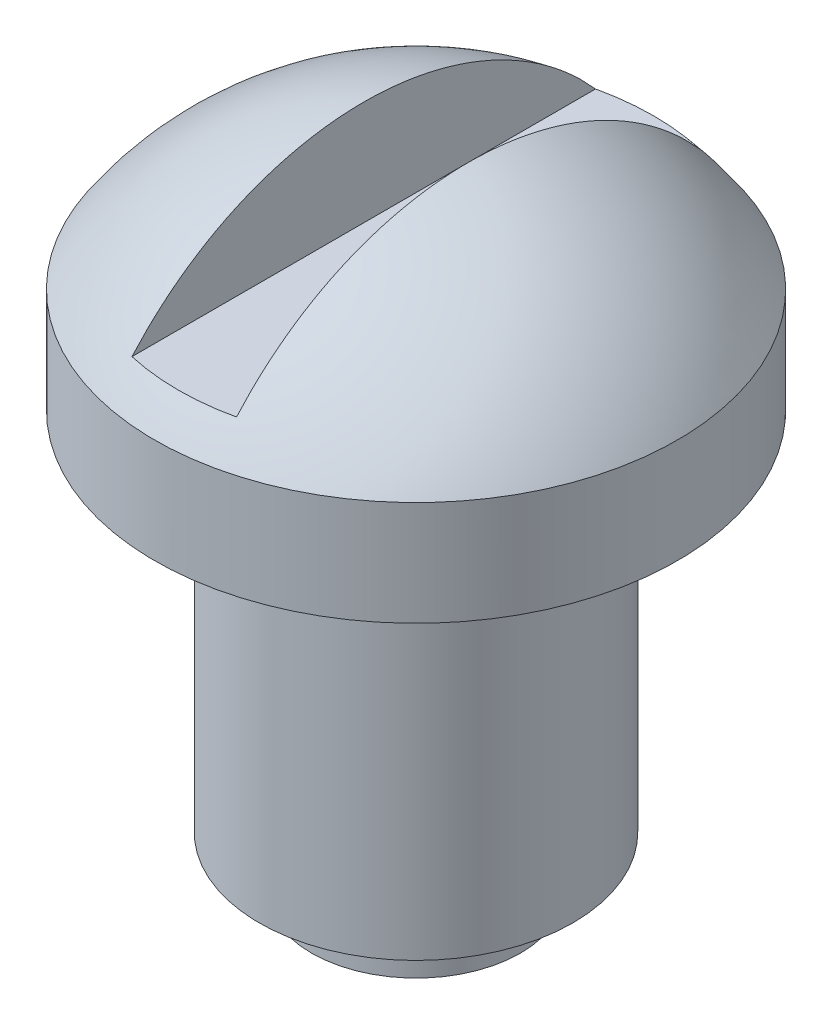
ISO-10303-21;
HEADER;
FILE_DESCRIPTION(('STEP AP214'),'2;1');
FILE_NAME('part.step','',(''),(''),'','','');
FILE_SCHEMA(('AUTOMOTIVE_DESIGN { 1 0 10303 214 1 1 1 1 }'));
ENDSEC;
DATA;
#1=APPLICATION_CONTEXT('core data for automotive mechanical design processes');
#2=APPLICATION_PROTOCOL_DEFINITION('international standard','automotive_design',2000,#1);
#3=PRODUCT_CONTEXT('',#1,'mechanical');
#4=PRODUCT('Part','Part','',(#3));
#5=PRODUCT_RELATED_PRODUCT_CATEGORY('part','',(#4));
#6=PRODUCT_DEFINITION_FORMATION('','',#4);
#7=PRODUCT_DEFINITION_CONTEXT('part definition',#1,'design');
#8=PRODUCT_DEFINITION('design','',#6,#7);
#9=PRODUCT_DEFINITION_SHAPE('','',#8);
#10=(LENGTH_UNIT() NAMED_UNIT(*) SI_UNIT(.MILLI.,.METRE.));
#11=(NAMED_UNIT(*) PLANE_ANGLE_UNIT() SI_UNIT($,.RADIAN.));
#12=(NAMED_UNIT(*) SI_UNIT($,.STERADIAN.) SOLID_ANGLE_UNIT());
#13=UNCERTAINTY_MEASURE_WITH_UNIT(LENGTH_MEASURE(1.E-05),#10,'distance_accuracy_value','');
#14=(GEOMETRIC_REPRESENTATION_CONTEXT(3) GLOBAL_UNCERTAINTY_ASSIGNED_CONTEXT((#13)) GLOBAL_UNIT_ASSIGNED_CONTEXT((#10,
#11,#12)) REPRESENTATION_CONTEXT('',''));
#15=CARTESIAN_POINT('',(0.,0.,0.));
#16=DIRECTION('',(0.,0.,1.));
#17=DIRECTION('',(1.,0.,0.));
#18=AXIS2_PLACEMENT_3D('',#15,#16,#17);
#19=CARTESIAN_POINT('',(0.,3.6833752096446,0.));
#20=DIRECTION('',(0.,1.,0.));
#21=DIRECTION('',(-1.,0.,0.));
#22=AXIS2_PLACEMENT_3D('',#19,#20,#21);
#23=CYLINDRICAL_SURFACE('',#22,5.);
#24=CARTESIAN_POINT('',(0.,1.,0.));
#25=DIRECTION('',(0.,1.,0.));
#26=DIRECTION('',(-1.,0.,0.));
#27=AXIS2_PLACEMENT_3D('',#24,#25,#26);
#28=CIRCLE('',#27,5.);
#29=CARTESIAN_POINT('',(-5.,1.,0.));
#30=VERTEX_POINT('',#29);
#31=EDGE_CURVE('E69',#30,#30,#28,.T.);
#32=ORIENTED_EDGE('',*,*,#31,.F.);
#33=EDGE_LOOP('',(#32));
#34=FACE_BOUND('',#33,.T.);
#35=CARTESIAN_POINT('',(0.,-1.,0.));
#36=DIRECTION('',(0.,1.,0.));
#37=DIRECTION('',(-1.,0.,0.));
#38=AXIS2_PLACEMENT_3D('',#35,#36,#37);
#39=CIRCLE('',#38,5.);
#40=CARTESIAN_POINT('',(-5.,-0.999999999999999,0.));
#41=VERTEX_POINT('',#40);
#42=EDGE_CURVE('E77',#41,#41,#39,.T.);
#43=ORIENTED_EDGE('',*,*,#42,.T.);
#44=EDGE_LOOP('',(#43));
#45=FACE_BOUND('',#44,.T.);
#46=ADVANCED_FACE('F33',(#34,#45),#23,.T.);
#47=CARTESIAN_POINT('',(0.,-2.3166247903554,0.));
#48=DIRECTION('',(0.,1.,0.));
#49=DIRECTION('',(1.,0.,0.));
#50=AXIS2_PLACEMENT_3D('',#47,#48,#49);
#51=SPHERICAL_SURFACE('',#50,6.);
#52=CARTESIAN_POINT('',(0.,1.59945499274422,0.));
#53=DIRECTION('',(0.,-1.,0.));
#54=DIRECTION('',(1.,0.,0.));
#55=AXIS2_PLACEMENT_3D('',#52,#53,#54);
#56=CIRCLE('',#55,4.54580236398355);
#57=CARTESIAN_POINT('',(1.,1.59945499274422,4.4344468800966));
#58=VERTEX_POINT('',#57);
#59=CARTESIAN_POINT('',(-1.,1.59945499274422,4.4344468800966));
#60=VERTEX_POINT('',#59);
#61=EDGE_CURVE('E66',#58,#60,#56,.T.);
#62=ORIENTED_EDGE('',*,*,#61,.T.);
#63=CARTESIAN_POINT('',(-1.,-2.3166247903554,0.));
#64=DIRECTION('',(-1.,0.,0.));
#65=DIRECTION('',(0.,0.,1.));
#66=AXIS2_PLACEMENT_3D('',#63,#64,#65);
#67=CIRCLE('',#66,5.91607978309962);
#68=CARTESIAN_POINT('',(-1.,1.59945499274422,-4.4344468800966));
#69=VERTEX_POINT('',#68);
#70=EDGE_CURVE('E36',#60,#69,#67,.T.);
#71=ORIENTED_EDGE('',*,*,#70,.T.);
#72=CARTESIAN_POINT('',(1.,1.59945499274422,-4.4344468800966));
#73=VERTEX_POINT('',#72);
#74=EDGE_CURVE('E49',#69,#73,#56,.T.);
#75=ORIENTED_EDGE('',*,*,#74,.T.);
#76=CARTESIAN_POINT('',(1.,-2.3166247903554,0.));
#77=DIRECTION('',(1.,0.,0.));
#78=DIRECTION('',(0.,1.,0.));
#79=AXIS2_PLACEMENT_3D('',#76,#77,#78);
#80=CIRCLE('',#79,5.91607978309962);
#81=EDGE_CURVE('E62',#73,#58,#80,.T.);
#82=ORIENTED_EDGE('',*,*,#81,.T.);
#83=EDGE_LOOP('',(#62,#71,#75,#82));
#84=FACE_BOUND('',#83,.T.);
#85=ORIENTED_EDGE('',*,*,#31,.T.);
#86=EDGE_LOOP('',(#85));
#87=FACE_BOUND('',#86,.T.);
#88=ADVANCED_FACE('F64',(#84,#87),#51,.T.);
#89=CARTESIAN_POINT('',(0.,-1.,0.));
#90=DIRECTION('',(0.,1.,0.));
#91=DIRECTION('',(-1.,0.,0.));
#92=AXIS2_PLACEMENT_3D('',#89,#90,#91);
#93=PLANE('',#92);
#94=CARTESIAN_POINT('',(0.,-1.,0.));
#95=DIRECTION('',(0.,-1.,0.));
#96=DIRECTION('',(1.,0.,0.));
#97=AXIS2_PLACEMENT_3D('',#94,#95,#96);
#98=CIRCLE('',#97,3.);
#99=CARTESIAN_POINT('',(3.,-1.,0.));
#100=VERTEX_POINT('',#99);
#101=EDGE_CURVE('E41',#100,#100,#98,.T.);
#102=ORIENTED_EDGE('',*,*,#101,.F.);
#103=EDGE_LOOP('',(#102));
#104=FACE_BOUND('',#103,.T.);
#105=ORIENTED_EDGE('',*,*,#42,.F.);
#106=EDGE_LOOP('',(#105));
#107=FACE_BOUND('',#106,.T.);
#108=ADVANCED_FACE('F93',(#104,#107),#93,.F.);
#109=CARTESIAN_POINT('',(-1.,3.59945499274422,18.6218119483877));
#110=DIRECTION('',(-1.,0.,0.));
#111=DIRECTION('',(0.,0.,1.));
#112=AXIS2_PLACEMENT_3D('',#109,#110,#111);
#113=PLANE('',#112);
#114=ORIENTED_EDGE('',*,*,#70,.F.);
#115=DIRECTION('',(0.,0.,-1.));
#116=VECTOR('',#115,1.);
#117=CARTESIAN_POINT('',(-1.,1.59945499274422,18.6218119483877));
#118=LINE('',#117,#116);
#119=EDGE_CURVE('E73',#60,#69,#118,.T.);
#120=ORIENTED_EDGE('',*,*,#119,.T.);
#121=EDGE_LOOP('',(#114,#120));
#122=FACE_BOUND('',#121,.T.);
#123=ADVANCED_FACE('F95',(#122),#113,.F.);
#124=CARTESIAN_POINT('',(-1.,1.59945499274422,18.6218119483877));
#125=DIRECTION('',(0.,-1.,0.));
#126=DIRECTION('',(1.,0.,0.));
#127=AXIS2_PLACEMENT_3D('',#124,#125,#126);
#128=PLANE('',#127);
#129=ORIENTED_EDGE('',*,*,#61,.F.);
#130=DIRECTION('',(0.,0.,-1.));
#131=VECTOR('',#130,1.);
#132=CARTESIAN_POINT('',(1.,1.59945499274422,18.6218119483877));
#133=LINE('',#132,#131);
#134=EDGE_CURVE('E72',#58,#73,#133,.T.);
#135=ORIENTED_EDGE('',*,*,#134,.T.);
#136=ORIENTED_EDGE('',*,*,#74,.F.);
#137=ORIENTED_EDGE('',*,*,#119,.F.);
#138=EDGE_LOOP('',(#129,#135,#136,#137));
#139=FACE_BOUND('',#138,.T.);
#140=ADVANCED_FACE('F71',(#139),#128,.F.);
#141=CARTESIAN_POINT('',(0.999999999999999,3.59945499274422,18.6218119483877));
#142=DIRECTION('',(1.,0.,0.));
#143=DIRECTION('',(0.,1.,0.));
#144=AXIS2_PLACEMENT_3D('',#141,#142,#143);
#145=PLANE('',#144);
#146=ORIENTED_EDGE('',*,*,#134,.F.);
#147=ORIENTED_EDGE('',*,*,#81,.F.);
#148=EDGE_LOOP('',(#146,#147));
#149=FACE_BOUND('',#148,.T.);
#150=ADVANCED_FACE('F74',(#149),#145,.F.);
#151=CARTESIAN_POINT('',(0.,-8.,0.));
#152=DIRECTION('',(0.,1.,0.));
#153=DIRECTION('',(-1.,0.,0.));
#154=AXIS2_PLACEMENT_3D('',#151,#152,#153);
#155=CYLINDRICAL_SURFACE('',#154,3.);
#156=CARTESIAN_POINT('',(0.,-8.,0.));
#157=DIRECTION('',(0.,-1.,0.));
#158=DIRECTION('',(1.,0.,0.));
#159=AXIS2_PLACEMENT_3D('',#156,#157,#158);
#160=CIRCLE('',#159,3.);
#161=CARTESIAN_POINT('',(3.,-8.,0.));
#162=VERTEX_POINT('',#161);
#163=EDGE_CURVE('E75',#162,#162,#160,.T.);
#164=ORIENTED_EDGE('',*,*,#163,.F.);
#165=EDGE_LOOP('',(#164));
#166=FACE_BOUND('',#165,.T.);
#167=ORIENTED_EDGE('',*,*,#101,.T.);
#168=EDGE_LOOP('',(#167));
#169=FACE_BOUND('',#168,.T.);
#170=ADVANCED_FACE('F109',(#166,#169),#155,.T.);
#171=CARTESIAN_POINT('',(0.,-8.,0.));
#172=DIRECTION('',(0.,-1.,0.));
#173=DIRECTION('',(1.,0.,0.));
#174=AXIS2_PLACEMENT_3D('',#171,#172,#173);
#175=PLANE('',#174);
#176=CARTESIAN_POINT('',(0.,-8.,0.));
#177=DIRECTION('',(0.,-1.,0.));
#178=DIRECTION('',(1.,0.,0.));
#179=AXIS2_PLACEMENT_3D('',#176,#177,#178);
#180=CIRCLE('',#179,2.);
#181=CARTESIAN_POINT('',(2.,-8.,0.));
#182=VERTEX_POINT('',#181);
#183=EDGE_CURVE('E11',#182,#182,#180,.T.);
#184=ORIENTED_EDGE('',*,*,#183,.F.);
#185=EDGE_LOOP('',(#184));
#186=FACE_BOUND('',#185,.T.);
#187=ORIENTED_EDGE('',*,*,#163,.T.);
#188=EDGE_LOOP('',(#187));
#189=FACE_BOUND('',#188,.T.);
#190=ADVANCED_FACE('F112',(#186,#189),#175,.T.);
#191=CARTESIAN_POINT('',(0.,-9.,0.));
#192=DIRECTION('',(0.,1.,0.));
#193=DIRECTION('',(-1.,0.,0.));
#194=AXIS2_PLACEMENT_3D('',#191,#192,#193);
#195=CYLINDRICAL_SURFACE('',#194,2.);
#196=CARTESIAN_POINT('',(0.,-9.,0.));
#197=DIRECTION('',(0.,-1.,0.));
#198=DIRECTION('',(1.,0.,0.));
#199=AXIS2_PLACEMENT_3D('',#196,#197,#198);
#200=CIRCLE('',#199,2.);
#201=CARTESIAN_POINT('',(2.,-9.,0.));
#202=VERTEX_POINT('',#201);
#203=EDGE_CURVE('E80',#202,#202,#200,.T.);
#204=ORIENTED_EDGE('',*,*,#203,.F.);
#205=EDGE_LOOP('',(#204));
#206=FACE_BOUND('',#205,.T.);
#207=ORIENTED_EDGE('',*,*,#183,.T.);
#208=EDGE_LOOP('',(#207));
#209=FACE_BOUND('',#208,.T.);
#210=ADVANCED_FACE('F116',(#206,#209),#195,.T.);
#211=CARTESIAN_POINT('',(0.,-9.,0.));
#212=DIRECTION('',(0.,-1.,0.));
#213=DIRECTION('',(1.,0.,0.));
#214=AXIS2_PLACEMENT_3D('',#211,#212,#213);
#215=PLANE('',#214);
#216=ORIENTED_EDGE('',*,*,#203,.T.);
#217=EDGE_LOOP('',(#216));
#218=FACE_BOUND('',#217,.T.);
#219=ADVANCED_FACE('F120',(#218),#215,.T.);
#220=CLOSED_SHELL('',(#46,#88,#108,#123,#140,#150,#170,#190,#210,#219));
#221=MANIFOLD_SOLID_BREP('B2',#220);
#222=ADVANCED_BREP_SHAPE_REPRESENTATION('',(#18,#221),#14);
#223=SHAPE_DEFINITION_REPRESENTATION(#9,#222);
ENDSEC;
END-ISO-10303-21;
